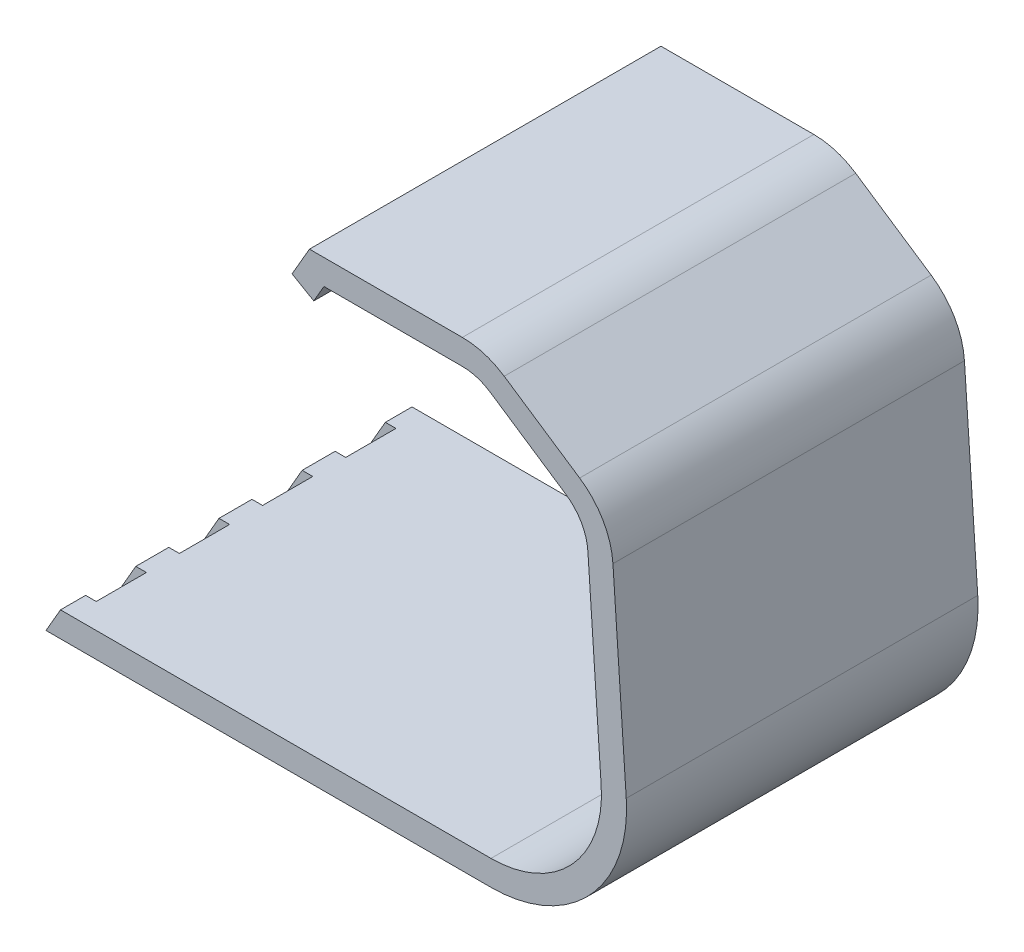
ISO-10303-21;
HEADER;
FILE_DESCRIPTION(('STEP AP214'),'2;1');
FILE_NAME('part.step','',(''),(''),'','','');
FILE_SCHEMA(('AUTOMOTIVE_DESIGN { 1 0 10303 214 1 1 1 1 }'));
ENDSEC;
DATA;
#1=APPLICATION_CONTEXT('core data for automotive mechanical design processes');
#2=APPLICATION_PROTOCOL_DEFINITION('international standard','automotive_design',2000,#1);
#3=PRODUCT_CONTEXT('',#1,'mechanical');
#4=PRODUCT('Part','Part','',(#3));
#5=PRODUCT_RELATED_PRODUCT_CATEGORY('part','',(#4));
#6=PRODUCT_DEFINITION_FORMATION('','',#4);
#7=PRODUCT_DEFINITION_CONTEXT('part definition',#1,'design');
#8=PRODUCT_DEFINITION('design','',#6,#7);
#9=PRODUCT_DEFINITION_SHAPE('','',#8);
#10=(LENGTH_UNIT() NAMED_UNIT(*) SI_UNIT(.MILLI.,.METRE.));
#11=(NAMED_UNIT(*) PLANE_ANGLE_UNIT() SI_UNIT($,.RADIAN.));
#12=(NAMED_UNIT(*) SI_UNIT($,.STERADIAN.) SOLID_ANGLE_UNIT());
#13=UNCERTAINTY_MEASURE_WITH_UNIT(LENGTH_MEASURE(1.E-05),#10,'distance_accuracy_value','');
#14=(GEOMETRIC_REPRESENTATION_CONTEXT(3) GLOBAL_UNCERTAINTY_ASSIGNED_CONTEXT((#13)) GLOBAL_UNIT_ASSIGNED_CONTEXT((#10,
#11,#12)) REPRESENTATION_CONTEXT('',''));
#15=CARTESIAN_POINT('',(0.,0.,0.));
#16=DIRECTION('',(0.,0.,1.));
#17=DIRECTION('',(1.,0.,0.));
#18=AXIS2_PLACEMENT_3D('',#15,#16,#17);
#19=CARTESIAN_POINT('',(115.26537180436,5.,35.));
#20=DIRECTION('',(0.,-1.,0.));
#21=DIRECTION('',(1.,0.,0.));
#22=AXIS2_PLACEMENT_3D('',#19,#20,#21);
#23=PLANE('',#22);
#24=DIRECTION('',(1.,0.,0.));
#25=VECTOR('',#24,1.);
#26=CARTESIAN_POINT('',(-2.2346281956398,5.00000000000002,-29.6875));
#27=LINE('',#26,#25);
#28=CARTESIAN_POINT('',(0.652123150308356,5.00000000000002,-29.6875));
#29=VERTEX_POINT('',#28);
#30=CARTESIAN_POINT('',(2.7653718043602,5.00000000000002,-29.6875));
#31=VERTEX_POINT('',#30);
#32=EDGE_CURVE('E272',#29,#31,#27,.T.);
#33=ORIENTED_EDGE('',*,*,#32,.T.);
#34=DIRECTION('',(0.,0.,-1.));
#35=VECTOR('',#34,1.);
#36=CARTESIAN_POINT('',(2.7653718043602,5.00000000000002,-19.6875));
#37=LINE('',#36,#35);
#38=CARTESIAN_POINT('',(2.7653718043602,5.00000000000002,-19.6875));
#39=VERTEX_POINT('',#38);
#40=EDGE_CURVE('E258',#39,#31,#37,.T.);
#41=ORIENTED_EDGE('',*,*,#40,.F.);
#42=DIRECTION('',(-1.,0.,0.));
#43=VECTOR('',#42,1.);
#44=CARTESIAN_POINT('',(2.7653718043602,5.00000000000002,-19.6875));
#45=LINE('',#44,#43);
#46=CARTESIAN_POINT('',(0.652123150308356,5.00000000000002,-19.6875));
#47=VERTEX_POINT('',#46);
#48=EDGE_CURVE('E266',#39,#47,#45,.T.);
#49=ORIENTED_EDGE('',*,*,#48,.T.);
#50=DIRECTION('',(0.,0.,1.));
#51=VECTOR('',#50,1.);
#52=CARTESIAN_POINT('',(0.652123150308351,5.00000000000002,-35.));
#53=LINE('',#52,#51);
#54=CARTESIAN_POINT('',(0.652123150308354,5.00000000000002,-13.125));
#55=VERTEX_POINT('',#54);
#56=EDGE_CURVE('E354',#47,#55,#53,.T.);
#57=ORIENTED_EDGE('',*,*,#56,.T.);
#58=DIRECTION('',(1.,0.,0.));
#59=VECTOR('',#58,1.);
#60=CARTESIAN_POINT('',(-2.2346281956398,5.00000000000002,-13.125));
#61=LINE('',#60,#59);
#62=CARTESIAN_POINT('',(2.7653718043602,5.00000000000002,-13.125));
#63=VERTEX_POINT('',#62);
#64=EDGE_CURVE('E287',#55,#63,#61,.T.);
#65=ORIENTED_EDGE('',*,*,#64,.T.);
#66=DIRECTION('',(0.,0.,-1.));
#67=VECTOR('',#66,1.);
#68=CARTESIAN_POINT('',(2.7653718043602,5.00000000000002,-3.125));
#69=LINE('',#68,#67);
#70=CARTESIAN_POINT('',(2.7653718043602,5.00000000000002,-3.125));
#71=VERTEX_POINT('',#70);
#72=EDGE_CURVE('E284',#71,#63,#69,.T.);
#73=ORIENTED_EDGE('',*,*,#72,.F.);
#74=DIRECTION('',(-1.,0.,0.));
#75=VECTOR('',#74,1.);
#76=CARTESIAN_POINT('',(2.7653718043602,5.00000000000002,-3.125));
#77=LINE('',#76,#75);
#78=CARTESIAN_POINT('',(0.652123150308354,5.00000000000002,-3.125));
#79=VERTEX_POINT('',#78);
#80=EDGE_CURVE('E281',#71,#79,#77,.T.);
#81=ORIENTED_EDGE('',*,*,#80,.T.);
#82=CARTESIAN_POINT('',(0.652123150308351,5.00000000000002,3.4375));
#83=VERTEX_POINT('',#82);
#84=EDGE_CURVE('E648',#79,#83,#53,.T.);
#85=ORIENTED_EDGE('',*,*,#84,.T.);
#86=DIRECTION('',(1.,0.,0.));
#87=VECTOR('',#86,1.);
#88=CARTESIAN_POINT('',(-2.2346281956398,5.00000000000002,3.4375));
#89=LINE('',#88,#87);
#90=CARTESIAN_POINT('',(2.7653718043602,5.00000000000002,3.4375));
#91=VERTEX_POINT('',#90);
#92=EDGE_CURVE('E307',#83,#91,#89,.T.);
#93=ORIENTED_EDGE('',*,*,#92,.T.);
#94=DIRECTION('',(0.,0.,-1.));
#95=VECTOR('',#94,1.);
#96=CARTESIAN_POINT('',(2.7653718043602,5.00000000000002,13.4375));
#97=LINE('',#96,#95);
#98=CARTESIAN_POINT('',(2.7653718043602,5.00000000000002,13.4375));
#99=VERTEX_POINT('',#98);
#100=EDGE_CURVE('E304',#99,#91,#97,.T.);
#101=ORIENTED_EDGE('',*,*,#100,.F.);
#102=DIRECTION('',(-1.,0.,0.));
#103=VECTOR('',#102,1.);
#104=CARTESIAN_POINT('',(2.7653718043602,5.00000000000002,13.4375));
#105=LINE('',#104,#103);
#106=CARTESIAN_POINT('',(0.652123150308351,5.00000000000002,13.4375));
#107=VERTEX_POINT('',#106);
#108=EDGE_CURVE('E301',#99,#107,#105,.T.);
#109=ORIENTED_EDGE('',*,*,#108,.T.);
#110=CARTESIAN_POINT('',(0.65212315030835,5.00000000000001,20.));
#111=VERTEX_POINT('',#110);
#112=EDGE_CURVE('E632',#107,#111,#53,.T.);
#113=ORIENTED_EDGE('',*,*,#112,.T.);
#114=DIRECTION('',(1.,0.,0.));
#115=VECTOR('',#114,1.);
#116=CARTESIAN_POINT('',(-2.2346281956398,5.00000000000001,20.));
#117=LINE('',#116,#115);
#118=CARTESIAN_POINT('',(2.7653718043602,5.00000000000001,20.));
#119=VERTEX_POINT('',#118);
#120=EDGE_CURVE('E328',#111,#119,#117,.T.);
#121=ORIENTED_EDGE('',*,*,#120,.T.);
#122=DIRECTION('',(0.,0.,-1.));
#123=VECTOR('',#122,1.);
#124=CARTESIAN_POINT('',(2.7653718043602,5.00000000000001,30.));
#125=LINE('',#124,#123);
#126=CARTESIAN_POINT('',(2.7653718043602,5.00000000000001,30.));
#127=VERTEX_POINT('',#126);
#128=EDGE_CURVE('E325',#127,#119,#125,.T.);
#129=ORIENTED_EDGE('',*,*,#128,.F.);
#130=DIRECTION('',(-1.,0.,0.));
#131=VECTOR('',#130,1.);
#132=CARTESIAN_POINT('',(2.7653718043602,5.00000000000001,30.));
#133=LINE('',#132,#131);
#134=CARTESIAN_POINT('',(0.65212315030835,5.00000000000001,30.));
#135=VERTEX_POINT('',#134);
#136=EDGE_CURVE('E322',#127,#135,#133,.T.);
#137=ORIENTED_EDGE('',*,*,#136,.T.);
#138=CARTESIAN_POINT('',(0.652123150308351,5.00000000000002,35.));
#139=VERTEX_POINT('',#138);
#140=EDGE_CURVE('E350',#135,#139,#53,.T.);
#141=ORIENTED_EDGE('',*,*,#140,.T.);
#142=DIRECTION('',(-1.,0.,0.));
#143=VECTOR('',#142,1.);
#144=CARTESIAN_POINT('',(115.26537180436,5.,35.));
#145=LINE('',#144,#143);
#146=CARTESIAN_POINT('',(86.3774038639351,5.,35.));
#147=VERTEX_POINT('',#146);
#148=EDGE_CURVE('E406',#147,#139,#145,.T.);
#149=ORIENTED_EDGE('',*,*,#148,.F.);
#150=DIRECTION('',(0.,0.,-1.));
#151=VECTOR('',#150,1.);
#152=CARTESIAN_POINT('',(86.3774038639351,5.,35.));
#153=LINE('',#152,#151);
#154=CARTESIAN_POINT('',(86.3774038639351,5.,-35.));
#155=VERTEX_POINT('',#154);
#156=EDGE_CURVE('E438',#147,#155,#153,.T.);
#157=ORIENTED_EDGE('',*,*,#156,.T.);
#158=DIRECTION('',(-1.,0.,0.));
#159=VECTOR('',#158,1.);
#160=CARTESIAN_POINT('',(115.26537180436,5.,-35.));
#161=LINE('',#160,#159);
#162=CARTESIAN_POINT('',(0.652123150308343,5.00000000000001,-35.));
#163=VERTEX_POINT('',#162);
#164=EDGE_CURVE('E371',#155,#163,#161,.T.);
#165=ORIENTED_EDGE('',*,*,#164,.T.);
#166=EDGE_CURVE('E351',#163,#29,#53,.T.);
#167=ORIENTED_EDGE('',*,*,#166,.T.);
#168=EDGE_LOOP('',(#33,#41,#49,#57,#65,#73,#81,#85,#93,#101,#109,#113,#121,#129,#137,#141,#149,
#157,#165,#167));
#169=FACE_BOUND('',#168,.T.);
#170=ADVANCED_FACE('F34',(#169),#23,.F.);
#171=CARTESIAN_POINT('',(115.26537180436,0.,35.));
#172=DIRECTION('',(0.,-1.,0.));
#173=DIRECTION('',(1.,0.,0.));
#174=AXIS2_PLACEMENT_3D('',#171,#172,#173);
#175=PLANE('',#174);
#176=DIRECTION('',(0.,0.,-1.));
#177=VECTOR('',#176,1.);
#178=CARTESIAN_POINT('',(2.7653718043602,0.,-19.6875));
#179=LINE('',#178,#177);
#180=CARTESIAN_POINT('',(2.7653718043602,0.,-19.6875));
#181=VERTEX_POINT('',#180);
#182=CARTESIAN_POINT('',(2.7653718043602,0.,-29.6875));
#183=VERTEX_POINT('',#182);
#184=EDGE_CURVE('E261',#181,#183,#179,.T.);
#185=ORIENTED_EDGE('',*,*,#184,.T.);
#186=DIRECTION('',(1.,0.,0.));
#187=VECTOR('',#186,1.);
#188=CARTESIAN_POINT('',(-2.2346281956398,0.,-29.6875));
#189=LINE('',#188,#187);
#190=CARTESIAN_POINT('',(-2.2346281956398,0.,-29.6875));
#191=VERTEX_POINT('',#190);
#192=EDGE_CURVE('E263',#191,#183,#189,.T.);
#193=ORIENTED_EDGE('',*,*,#192,.F.);
#194=DIRECTION('',(0.,0.,-1.));
#195=VECTOR('',#194,1.);
#196=CARTESIAN_POINT('',(-2.2346281956398,0.,35.));
#197=LINE('',#196,#195);
#198=CARTESIAN_POINT('',(-2.2346281956398,0.,-35.));
#199=VERTEX_POINT('',#198);
#200=EDGE_CURVE('E429',#191,#199,#197,.T.);
#201=ORIENTED_EDGE('',*,*,#200,.T.);
#202=DIRECTION('',(-1.,0.,0.));
#203=VECTOR('',#202,1.);
#204=CARTESIAN_POINT('',(115.26537180436,0.,-35.));
#205=LINE('',#204,#203);
#206=CARTESIAN_POINT('',(86.3774038639351,0.,-35.));
#207=VERTEX_POINT('',#206);
#208=EDGE_CURVE('E368',#207,#199,#205,.T.);
#209=ORIENTED_EDGE('',*,*,#208,.F.);
#210=DIRECTION('',(0.,0.,-1.));
#211=VECTOR('',#210,1.);
#212=CARTESIAN_POINT('',(86.3774038639351,0.,35.));
#213=LINE('',#212,#211);
#214=CARTESIAN_POINT('',(86.3774038639351,0.,35.));
#215=VERTEX_POINT('',#214);
#216=EDGE_CURVE('E455',#207,#215,#213,.F.);
#217=ORIENTED_EDGE('',*,*,#216,.T.);
#218=DIRECTION('',(-1.,0.,0.));
#219=VECTOR('',#218,1.);
#220=CARTESIAN_POINT('',(115.26537180436,0.,35.));
#221=LINE('',#220,#219);
#222=CARTESIAN_POINT('',(-2.2346281956398,0.,35.));
#223=VERTEX_POINT('',#222);
#224=EDGE_CURVE('E403',#215,#223,#221,.T.);
#225=ORIENTED_EDGE('',*,*,#224,.T.);
#226=CARTESIAN_POINT('',(-2.2346281956398,0.,30.));
#227=VERTEX_POINT('',#226);
#228=EDGE_CURVE('E430',#223,#227,#197,.T.);
#229=ORIENTED_EDGE('',*,*,#228,.T.);
#230=DIRECTION('',(-1.,0.,0.));
#231=VECTOR('',#230,1.);
#232=CARTESIAN_POINT('',(2.7653718043602,0.,30.));
#233=LINE('',#232,#231);
#234=CARTESIAN_POINT('',(2.7653718043602,0.,30.));
#235=VERTEX_POINT('',#234);
#236=EDGE_CURVE('E331',#235,#227,#233,.T.);
#237=ORIENTED_EDGE('',*,*,#236,.F.);
#238=DIRECTION('',(0.,0.,-1.));
#239=VECTOR('',#238,1.);
#240=CARTESIAN_POINT('',(2.7653718043602,0.,30.));
#241=LINE('',#240,#239);
#242=CARTESIAN_POINT('',(2.7653718043602,0.,20.));
#243=VERTEX_POINT('',#242);
#244=EDGE_CURVE('E333',#235,#243,#241,.T.);
#245=ORIENTED_EDGE('',*,*,#244,.T.);
#246=DIRECTION('',(1.,0.,0.));
#247=VECTOR('',#246,1.);
#248=CARTESIAN_POINT('',(-2.2346281956398,0.,20.));
#249=LINE('',#248,#247);
#250=CARTESIAN_POINT('',(-2.2346281956398,0.,20.));
#251=VERTEX_POINT('',#250);
#252=EDGE_CURVE('E336',#251,#243,#249,.T.);
#253=ORIENTED_EDGE('',*,*,#252,.F.);
#254=CARTESIAN_POINT('',(-2.2346281956398,0.,13.4375));
#255=VERTEX_POINT('',#254);
#256=EDGE_CURVE('E434',#251,#255,#197,.T.);
#257=ORIENTED_EDGE('',*,*,#256,.T.);
#258=DIRECTION('',(-1.,0.,0.));
#259=VECTOR('',#258,1.);
#260=CARTESIAN_POINT('',(2.7653718043602,0.,13.4375));
#261=LINE('',#260,#259);
#262=CARTESIAN_POINT('',(2.7653718043602,0.,13.4375));
#263=VERTEX_POINT('',#262);
#264=EDGE_CURVE('E310',#263,#255,#261,.T.);
#265=ORIENTED_EDGE('',*,*,#264,.F.);
#266=DIRECTION('',(0.,0.,-1.));
#267=VECTOR('',#266,1.);
#268=CARTESIAN_POINT('',(2.7653718043602,0.,13.4375));
#269=LINE('',#268,#267);
#270=CARTESIAN_POINT('',(2.7653718043602,0.,3.4375));
#271=VERTEX_POINT('',#270);
#272=EDGE_CURVE('E312',#263,#271,#269,.T.);
#273=ORIENTED_EDGE('',*,*,#272,.T.);
#274=DIRECTION('',(1.,0.,0.));
#275=VECTOR('',#274,1.);
#276=CARTESIAN_POINT('',(-2.2346281956398,0.,3.4375));
#277=LINE('',#276,#275);
#278=CARTESIAN_POINT('',(-2.2346281956398,0.,3.4375));
#279=VERTEX_POINT('',#278);
#280=EDGE_CURVE('E315',#279,#271,#277,.T.);
#281=ORIENTED_EDGE('',*,*,#280,.F.);
#282=CARTESIAN_POINT('',(-2.2346281956398,0.,-3.125));
#283=VERTEX_POINT('',#282);
#284=EDGE_CURVE('E525',#279,#283,#197,.T.);
#285=ORIENTED_EDGE('',*,*,#284,.T.);
#286=DIRECTION('',(-1.,0.,0.));
#287=VECTOR('',#286,1.);
#288=CARTESIAN_POINT('',(2.7653718043602,0.,-3.125));
#289=LINE('',#288,#287);
#290=CARTESIAN_POINT('',(2.7653718043602,0.,-3.125));
#291=VERTEX_POINT('',#290);
#292=EDGE_CURVE('E57',#291,#283,#289,.T.);
#293=ORIENTED_EDGE('',*,*,#292,.F.);
#294=DIRECTION('',(0.,0.,-1.));
#295=VECTOR('',#294,1.);
#296=CARTESIAN_POINT('',(2.7653718043602,0.,-3.125));
#297=LINE('',#296,#295);
#298=CARTESIAN_POINT('',(2.7653718043602,0.,-13.125));
#299=VERTEX_POINT('',#298);
#300=EDGE_CURVE('E291',#291,#299,#297,.T.);
#301=ORIENTED_EDGE('',*,*,#300,.T.);
#302=DIRECTION('',(1.,0.,0.));
#303=VECTOR('',#302,1.);
#304=CARTESIAN_POINT('',(-2.2346281956398,0.,-13.125));
#305=LINE('',#304,#303);
#306=CARTESIAN_POINT('',(-2.2346281956398,0.,-13.125));
#307=VERTEX_POINT('',#306);
#308=EDGE_CURVE('E294',#307,#299,#305,.T.);
#309=ORIENTED_EDGE('',*,*,#308,.F.);
#310=CARTESIAN_POINT('',(-2.2346281956398,0.,-19.6875));
#311=VERTEX_POINT('',#310);
#312=EDGE_CURVE('E522',#307,#311,#197,.T.);
#313=ORIENTED_EDGE('',*,*,#312,.T.);
#314=DIRECTION('',(-1.,0.,0.));
#315=VECTOR('',#314,1.);
#316=CARTESIAN_POINT('',(2.7653718043602,0.,-19.6875));
#317=LINE('',#316,#315);
#318=EDGE_CURVE('E49',#181,#311,#317,.T.);
#319=ORIENTED_EDGE('',*,*,#318,.F.);
#320=EDGE_LOOP('',(#185,#193,#201,#209,#217,#225,#229,#237,#245,#253,#257,#265,#273,#281,#285,
#293,#301,#309,#313,#319));
#321=FACE_BOUND('',#320,.T.);
#322=ADVANCED_FACE('F521',(#321),#175,.T.);
#323=CARTESIAN_POINT('',(-2.2346281956398,0.,-35.));
#324=DIRECTION('',(0.866025403784437,-0.500000000000003,0.));
#325=DIRECTION('',(0.500000000000003,0.866025403784437,0.));
#326=AXIS2_PLACEMENT_3D('',#323,#324,#325);
#327=PLANE('',#326);
#328=DIRECTION('',(-0.500000000000003,-0.866025403784437,0.));
#329=VECTOR('',#328,1.);
#330=CARTESIAN_POINT('',(-2.2346281956398,0.,-29.6875));
#331=LINE('',#330,#329);
#332=EDGE_CURVE('E11',#29,#191,#331,.T.);
#333=ORIENTED_EDGE('',*,*,#332,.F.);
#334=ORIENTED_EDGE('',*,*,#166,.F.);
#335=DIRECTION('',(0.500000000000003,0.866025403784437,0.));
#336=VECTOR('',#335,1.);
#337=CARTESIAN_POINT('',(-2.2346281956398,0.,-35.));
#338=LINE('',#337,#336);
#339=EDGE_CURVE('E347',#199,#163,#338,.T.);
#340=ORIENTED_EDGE('',*,*,#339,.F.);
#341=ORIENTED_EDGE('',*,*,#200,.F.);
#342=EDGE_LOOP('',(#333,#334,#340,#341));
#343=FACE_BOUND('',#342,.T.);
#344=ADVANCED_FACE('F539',(#343),#327,.F.);
#345=DIRECTION('',(0.500000000000003,0.866025403784437,0.));
#346=VECTOR('',#345,1.);
#347=CARTESIAN_POINT('',(-2.2346281956398,0.,-19.6875));
#348=LINE('',#347,#346);
#349=EDGE_CURVE('E42',#311,#47,#348,.T.);
#350=ORIENTED_EDGE('',*,*,#349,.F.);
#351=ORIENTED_EDGE('',*,*,#312,.F.);
#352=DIRECTION('',(-0.500000000000003,-0.866025403784437,0.));
#353=VECTOR('',#352,1.);
#354=CARTESIAN_POINT('',(-2.2346281956398,0.,-13.125));
#355=LINE('',#354,#353);
#356=EDGE_CURVE('E511',#55,#307,#355,.T.);
#357=ORIENTED_EDGE('',*,*,#356,.F.);
#358=ORIENTED_EDGE('',*,*,#56,.F.);
#359=EDGE_LOOP('',(#350,#351,#357,#358));
#360=FACE_BOUND('',#359,.T.);
#361=ADVANCED_FACE('F524',(#360),#327,.F.);
#362=DIRECTION('',(0.500000000000003,0.866025403784437,0.));
#363=VECTOR('',#362,1.);
#364=CARTESIAN_POINT('',(-2.2346281956398,0.,-3.125));
#365=LINE('',#364,#363);
#366=EDGE_CURVE('E509',#283,#79,#365,.T.);
#367=ORIENTED_EDGE('',*,*,#366,.F.);
#368=ORIENTED_EDGE('',*,*,#284,.F.);
#369=DIRECTION('',(-0.500000000000003,-0.866025403784437,0.));
#370=VECTOR('',#369,1.);
#371=CARTESIAN_POINT('',(-2.2346281956398,0.,3.4375));
#372=LINE('',#371,#370);
#373=EDGE_CURVE('E507',#83,#279,#372,.T.);
#374=ORIENTED_EDGE('',*,*,#373,.F.);
#375=ORIENTED_EDGE('',*,*,#84,.F.);
#376=EDGE_LOOP('',(#367,#368,#374,#375));
#377=FACE_BOUND('',#376,.T.);
#378=ADVANCED_FACE('F646',(#377),#327,.F.);
#379=DIRECTION('',(0.500000000000003,0.866025403784437,0.));
#380=VECTOR('',#379,1.);
#381=CARTESIAN_POINT('',(-2.2346281956398,0.,13.4375));
#382=LINE('',#381,#380);
#383=EDGE_CURVE('E505',#255,#107,#382,.T.);
#384=ORIENTED_EDGE('',*,*,#383,.F.);
#385=ORIENTED_EDGE('',*,*,#256,.F.);
#386=DIRECTION('',(-0.500000000000003,-0.866025403784437,0.));
#387=VECTOR('',#386,1.);
#388=CARTESIAN_POINT('',(-2.2346281956398,0.,20.));
#389=LINE('',#388,#387);
#390=EDGE_CURVE('E503',#111,#251,#389,.T.);
#391=ORIENTED_EDGE('',*,*,#390,.F.);
#392=ORIENTED_EDGE('',*,*,#112,.F.);
#393=EDGE_LOOP('',(#384,#385,#391,#392));
#394=FACE_BOUND('',#393,.T.);
#395=ADVANCED_FACE('F630',(#394),#327,.F.);
#396=DIRECTION('',(0.500000000000003,0.866025403784437,0.));
#397=VECTOR('',#396,1.);
#398=CARTESIAN_POINT('',(-2.2346281956398,0.,30.));
#399=LINE('',#398,#397);
#400=EDGE_CURVE('E501',#227,#135,#399,.T.);
#401=ORIENTED_EDGE('',*,*,#400,.F.);
#402=ORIENTED_EDGE('',*,*,#228,.F.);
#403=DIRECTION('',(0.500000000000003,0.866025403784437,0.));
#404=VECTOR('',#403,1.);
#405=CARTESIAN_POINT('',(-2.2346281956398,0.,35.));
#406=LINE('',#405,#404);
#407=EDGE_CURVE('E343',#223,#139,#406,.T.);
#408=ORIENTED_EDGE('',*,*,#407,.T.);
#409=ORIENTED_EDGE('',*,*,#140,.F.);
#410=EDGE_LOOP('',(#401,#402,#408,#409));
#411=FACE_BOUND('',#410,.T.);
#412=ADVANCED_FACE('F611',(#411),#327,.F.);
#413=CARTESIAN_POINT('',(51.0954988232824,83.5,35.));
#414=DIRECTION('',(-0.500000000000003,-0.866025403784437,0.));
#415=DIRECTION('',(0.866025403784437,-0.500000000000003,0.));
#416=AXIS2_PLACEMENT_3D('',#413,#414,#415);
#417=PLANE('',#416);
#418=DIRECTION('',(0.,0.,-1.));
#419=VECTOR('',#418,1.);
#420=CARTESIAN_POINT('',(51.0954988232824,83.5,35.));
#421=LINE('',#420,#419);
#422=CARTESIAN_POINT('',(51.0954988232824,83.5,35.));
#423=VERTEX_POINT('',#422);
#424=CARTESIAN_POINT('',(51.0954988232824,83.5,-35.));
#425=VERTEX_POINT('',#424);
#426=EDGE_CURVE('E436',#423,#425,#421,.T.);
#427=ORIENTED_EDGE('',*,*,#426,.F.);
#428=DIRECTION('',(-0.866025403784437,0.500000000000003,0.));
#429=VECTOR('',#428,1.);
#430=CARTESIAN_POINT('',(51.0954988232824,83.5,35.));
#431=LINE('',#430,#429);
#432=CARTESIAN_POINT('',(46.7653718043602,86.,35.));
#433=VERTEX_POINT('',#432);
#434=EDGE_CURVE('E384',#423,#433,#431,.T.);
#435=ORIENTED_EDGE('',*,*,#434,.T.);
#436=DIRECTION('',(0.,0.,-1.));
#437=VECTOR('',#436,1.);
#438=CARTESIAN_POINT('',(46.7653718043602,86.,35.));
#439=LINE('',#438,#437);
#440=CARTESIAN_POINT('',(46.7653718043602,86.,-35.));
#441=VERTEX_POINT('',#440);
#442=EDGE_CURVE('E425',#433,#441,#439,.T.);
#443=ORIENTED_EDGE('',*,*,#442,.T.);
#444=DIRECTION('',(-0.866025403784437,0.500000000000003,0.));
#445=VECTOR('',#444,1.);
#446=CARTESIAN_POINT('',(51.0954988232824,83.5,-35.));
#447=LINE('',#446,#445);
#448=EDGE_CURVE('E353',#425,#441,#447,.T.);
#449=ORIENTED_EDGE('',*,*,#448,.F.);
#450=EDGE_LOOP('',(#427,#435,#443,#449));
#451=FACE_BOUND('',#450,.T.);
#452=ADVANCED_FACE('F680',(#451),#417,.T.);
#453=CARTESIAN_POINT('',(51.0954988232824,83.5,35.));
#454=DIRECTION('',(-0.866025403784437,0.500000000000003,0.));
#455=DIRECTION('',(-0.500000000000003,-0.866025403784437,0.));
#456=AXIS2_PLACEMENT_3D('',#453,#454,#455);
#457=PLANE('',#456);
#458=DIRECTION('',(0.,0.,-1.));
#459=VECTOR('',#458,1.);
#460=CARTESIAN_POINT('',(53.1162247654461,87.,35.));
#461=LINE('',#460,#459);
#462=CARTESIAN_POINT('',(53.1162247654461,87.,35.));
#463=VERTEX_POINT('',#462);
#464=CARTESIAN_POINT('',(53.1162247654461,87.,-35.));
#465=VERTEX_POINT('',#464);
#466=EDGE_CURVE('E433',#463,#465,#461,.T.);
#467=ORIENTED_EDGE('',*,*,#466,.F.);
#468=DIRECTION('',(0.500000000000003,0.866025403784437,0.));
#469=VECTOR('',#468,1.);
#470=CARTESIAN_POINT('',(51.0954988232824,83.5,35.));
#471=LINE('',#470,#469);
#472=EDGE_CURVE('E421',#423,#463,#471,.T.);
#473=ORIENTED_EDGE('',*,*,#472,.F.);
#474=ORIENTED_EDGE('',*,*,#426,.T.);
#475=DIRECTION('',(0.500000000000003,0.866025403784437,0.));
#476=VECTOR('',#475,1.);
#477=CARTESIAN_POINT('',(51.0954988232824,83.5,-35.));
#478=LINE('',#477,#476);
#479=EDGE_CURVE('E381',#425,#465,#478,.T.);
#480=ORIENTED_EDGE('',*,*,#479,.T.);
#481=EDGE_LOOP('',(#467,#473,#474,#480));
#482=FACE_BOUND('',#481,.T.);
#483=ADVANCED_FACE('F36',(#482),#457,.F.);
#484=CARTESIAN_POINT('',(50.229473419498,87.,35.));
#485=DIRECTION('',(0.,1.,0.));
#486=DIRECTION('',(0.,0.,1.));
#487=AXIS2_PLACEMENT_3D('',#484,#485,#486);
#488=PLANE('',#487);
#489=DIRECTION('',(1.,0.,0.));
#490=VECTOR('',#489,1.);
#491=CARTESIAN_POINT('',(50.229473419498,87.,-35.));
#492=LINE('',#491,#490);
#493=CARTESIAN_POINT('',(80.677626658111,87.,-35.));
#494=VERTEX_POINT('',#493);
#495=EDGE_CURVE('E378',#465,#494,#492,.T.);
#496=ORIENTED_EDGE('',*,*,#495,.T.);
#497=DIRECTION('',(0.,0.,-1.));
#498=VECTOR('',#497,1.);
#499=CARTESIAN_POINT('',(80.677626658111,87.,35.));
#500=LINE('',#499,#498);
#501=CARTESIAN_POINT('',(80.677626658111,87.,35.));
#502=VERTEX_POINT('',#501);
#503=EDGE_CURVE('E486',#494,#502,#500,.F.);
#504=ORIENTED_EDGE('',*,*,#503,.T.);
#505=DIRECTION('',(1.,0.,0.));
#506=VECTOR('',#505,1.);
#507=CARTESIAN_POINT('',(50.229473419498,87.,35.));
#508=LINE('',#507,#506);
#509=EDGE_CURVE('E417',#463,#502,#508,.T.);
#510=ORIENTED_EDGE('',*,*,#509,.F.);
#511=ORIENTED_EDGE('',*,*,#466,.T.);
#512=EDGE_LOOP('',(#496,#504,#510,#511));
#513=FACE_BOUND('',#512,.T.);
#514=ADVANCED_FACE('F567',(#513),#488,.F.);
#515=CARTESIAN_POINT('',(82.4507865627108,87.8432104513317,35.));
#516=DIRECTION('',(0.55573737135744,0.831357909733662,0.));
#517=DIRECTION('',(-0.831357909733662,0.55573737135744,0.));
#518=AXIS2_PLACEMENT_3D('',#515,#516,#517);
#519=PLANE('',#518);
#520=DIRECTION('',(0.831357909733662,-0.555737371357439,0.));
#521=VECTOR('',#520,1.);
#522=CARTESIAN_POINT('',(82.4507865627108,87.8432104513317,35.));
#523=LINE('',#522,#521);
#524=CARTESIAN_POINT('',(86.2350003716854,85.3135790973366,35.));
#525=VERTEX_POINT('',#524);
#526=CARTESIAN_POINT('',(101.25954480802,75.2701300206729,35.));
#527=VERTEX_POINT('',#526);
#528=EDGE_CURVE('E413',#525,#527,#523,.T.);
#529=ORIENTED_EDGE('',*,*,#528,.F.);
#530=DIRECTION('',(0.,0.,-1.));
#531=VECTOR('',#530,1.);
#532=CARTESIAN_POINT('',(86.2350003716854,85.3135790973366,35.));
#533=LINE('',#532,#531);
#534=CARTESIAN_POINT('',(86.2350003716854,85.3135790973366,-35.));
#535=VERTEX_POINT('',#534);
#536=EDGE_CURVE('E483',#525,#535,#533,.T.);
#537=ORIENTED_EDGE('',*,*,#536,.T.);
#538=DIRECTION('',(0.831357909733662,-0.555737371357439,0.));
#539=VECTOR('',#538,1.);
#540=CARTESIAN_POINT('',(82.4507865627108,87.8432104513317,-35.));
#541=LINE('',#540,#539);
#542=CARTESIAN_POINT('',(101.25954480802,75.2701300206729,-35.));
#543=VERTEX_POINT('',#542);
#544=EDGE_CURVE('E375',#535,#543,#541,.T.);
#545=ORIENTED_EDGE('',*,*,#544,.T.);
#546=DIRECTION('',(0.,0.,-1.));
#547=VECTOR('',#546,1.);
#548=CARTESIAN_POINT('',(101.25954480802,75.2701300206729,35.));
#549=LINE('',#548,#547);
#550=EDGE_CURVE('E481',#543,#527,#549,.F.);
#551=ORIENTED_EDGE('',*,*,#550,.T.);
#552=EDGE_LOOP('',(#529,#537,#545,#551));
#553=FACE_BOUND('',#552,.T.);
#554=ADVANCED_FACE('F558',(#553),#519,.F.);
#555=CARTESIAN_POINT('',(105.181609462549,74.990450972333,35.));
#556=DIRECTION('',(0.997720249791746,0.0674855773887729,0.));
#557=DIRECTION('',(-0.0674855773887729,0.997720249791746,0.));
#558=AXIS2_PLACEMENT_3D('',#555,#556,#557);
#559=PLANE('',#558);
#560=DIRECTION('',(0.0674855773887729,-0.997720249791746,0.));
#561=VECTOR('',#560,1.);
#562=CARTESIAN_POINT('',(105.181609462549,74.990450972333,35.));
#563=LINE('',#562,#561);
#564=CARTESIAN_POINT('',(105.679373592363,67.6314066972241,35.));
#565=VERTEX_POINT('',#564);
#566=CARTESIAN_POINT('',(108.327249359354,28.484682702553,35.));
#567=VERTEX_POINT('',#566);
#568=EDGE_CURVE('E410',#565,#567,#563,.T.);
#569=ORIENTED_EDGE('',*,*,#568,.F.);
#570=DIRECTION('',(0.,0.,-1.));
#571=VECTOR('',#570,1.);
#572=CARTESIAN_POINT('',(105.679373592363,67.6314066972241,35.));
#573=LINE('',#572,#571);
#574=CARTESIAN_POINT('',(105.679373592363,67.6314066972241,-35.));
#575=VERTEX_POINT('',#574);
#576=EDGE_CURVE('E488',#565,#575,#573,.T.);
#577=ORIENTED_EDGE('',*,*,#576,.T.);
#578=DIRECTION('',(0.0674855773887729,-0.997720249791746,0.));
#579=VECTOR('',#578,1.);
#580=CARTESIAN_POINT('',(105.181609462549,74.990450972333,-35.));
#581=LINE('',#580,#579);
#582=CARTESIAN_POINT('',(108.327249359354,28.484682702553,-35.));
#583=VERTEX_POINT('',#582);
#584=EDGE_CURVE('E373',#575,#583,#581,.T.);
#585=ORIENTED_EDGE('',*,*,#584,.T.);
#586=DIRECTION('',(0.,0.,-1.));
#587=VECTOR('',#586,1.);
#588=CARTESIAN_POINT('',(108.327249359354,28.484682702553,35.));
#589=LINE('',#588,#587);
#590=EDGE_CURVE('E441',#583,#567,#589,.F.);
#591=ORIENTED_EDGE('',*,*,#590,.T.);
#592=EDGE_LOOP('',(#569,#577,#585,#591));
#593=FACE_BOUND('',#592,.T.);
#594=ADVANCED_FACE('F549',(#593),#559,.F.);
#595=CARTESIAN_POINT('',(110.170210711508,75.3278788592768,35.));
#596=DIRECTION('',(0.997720249791746,0.0674855773887729,0.));
#597=DIRECTION('',(-0.0674855773887729,0.997720249791746,0.));
#598=AXIS2_PLACEMENT_3D('',#595,#596,#597);
#599=PLANE('',#598);
#600=DIRECTION('',(0.0674855773887729,-0.997720249791746,0.));
#601=VECTOR('',#600,1.);
#602=CARTESIAN_POINT('',(110.170210711508,75.3278788592768,-35.));
#603=LINE('',#602,#601);
#604=CARTESIAN_POINT('',(110.667974841322,67.9688345841679,-35.));
#605=VERTEX_POINT('',#604);
#606=CARTESIAN_POINT('',(113.315850608312,28.8221105894969,-35.));
#607=VERTEX_POINT('',#606);
#608=EDGE_CURVE('E366',#605,#607,#603,.T.);
#609=ORIENTED_EDGE('',*,*,#608,.F.);
#610=DIRECTION('',(0.,0.,-1.));
#611=VECTOR('',#610,1.);
#612=CARTESIAN_POINT('',(110.667974841322,67.9688345841679,35.));
#613=LINE('',#612,#611);
#614=CARTESIAN_POINT('',(110.667974841322,67.9688345841679,35.));
#615=VERTEX_POINT('',#614);
#616=EDGE_CURVE('E470',#605,#615,#613,.F.);
#617=ORIENTED_EDGE('',*,*,#616,.T.);
#618=DIRECTION('',(0.0674855773887729,-0.997720249791746,0.));
#619=VECTOR('',#618,1.);
#620=CARTESIAN_POINT('',(110.170210711508,75.3278788592768,35.));
#621=LINE('',#620,#619);
#622=CARTESIAN_POINT('',(113.315850608312,28.8221105894969,35.));
#623=VERTEX_POINT('',#622);
#624=EDGE_CURVE('E400',#615,#623,#621,.T.);
#625=ORIENTED_EDGE('',*,*,#624,.T.);
#626=DIRECTION('',(0.,0.,-1.));
#627=VECTOR('',#626,1.);
#628=CARTESIAN_POINT('',(113.315850608312,28.8221105894969,35.));
#629=LINE('',#628,#627);
#630=EDGE_CURVE('E450',#623,#607,#629,.T.);
#631=ORIENTED_EDGE('',*,*,#630,.T.);
#632=EDGE_LOOP('',(#609,#617,#625,#631));
#633=FACE_BOUND('',#632,.T.);
#634=ADVANCED_FACE('F600',(#633),#599,.T.);
#635=CARTESIAN_POINT('',(85.229473419498,92.,35.));
#636=DIRECTION('',(0.55573737135744,0.831357909733662,0.));
#637=DIRECTION('',(-0.831357909733662,0.55573737135744,0.));
#638=AXIS2_PLACEMENT_3D('',#635,#636,#637);
#639=PLANE('',#638);
#640=DIRECTION('',(0.831357909733662,-0.55573737135744,0.));
#641=VECTOR('',#640,1.);
#642=CARTESIAN_POINT('',(85.229473419498,92.,35.));
#643=LINE('',#642,#641);
#644=CARTESIAN_POINT('',(89.0136872284726,89.4703686460049,35.));
#645=VERTEX_POINT('',#644);
#646=CARTESIAN_POINT('',(104.038231664807,79.4269195693413,35.));
#647=VERTEX_POINT('',#646);
#648=EDGE_CURVE('E396',#645,#647,#643,.T.);
#649=ORIENTED_EDGE('',*,*,#648,.T.);
#650=DIRECTION('',(0.,0.,-1.));
#651=VECTOR('',#650,1.);
#652=CARTESIAN_POINT('',(104.038231664807,79.4269195693413,35.));
#653=LINE('',#652,#651);
#654=CARTESIAN_POINT('',(104.038231664807,79.4269195693413,-35.));
#655=VERTEX_POINT('',#654);
#656=EDGE_CURVE('E463',#647,#655,#653,.T.);
#657=ORIENTED_EDGE('',*,*,#656,.T.);
#658=DIRECTION('',(0.831357909733662,-0.55573737135744,0.));
#659=VECTOR('',#658,1.);
#660=CARTESIAN_POINT('',(85.229473419498,92.,-35.));
#661=LINE('',#660,#659);
#662=CARTESIAN_POINT('',(89.0136872284726,89.4703686460049,-35.));
#663=VERTEX_POINT('',#662);
#664=EDGE_CURVE('E363',#663,#655,#661,.T.);
#665=ORIENTED_EDGE('',*,*,#664,.F.);
#666=DIRECTION('',(0.,0.,-1.));
#667=VECTOR('',#666,1.);
#668=CARTESIAN_POINT('',(89.0136872284726,89.4703686460049,35.));
#669=LINE('',#668,#667);
#670=EDGE_CURVE('E461',#663,#645,#669,.F.);
#671=ORIENTED_EDGE('',*,*,#670,.T.);
#672=EDGE_LOOP('',(#649,#657,#665,#671));
#673=FACE_BOUND('',#672,.T.);
#674=ADVANCED_FACE('F586',(#673),#639,.T.);
#675=CARTESIAN_POINT('',(50.229473419498,92.,35.));
#676=DIRECTION('',(0.,1.,0.));
#677=DIRECTION('',(0.,0.,1.));
#678=AXIS2_PLACEMENT_3D('',#675,#676,#677);
#679=PLANE('',#678);
#680=DIRECTION('',(1.,0.,0.));
#681=VECTOR('',#680,1.);
#682=CARTESIAN_POINT('',(50.229473419498,92.,35.));
#683=LINE('',#682,#681);
#684=CARTESIAN_POINT('',(50.229473419498,92.,35.));
#685=VERTEX_POINT('',#684);
#686=CARTESIAN_POINT('',(80.677626658111,92.,35.));
#687=VERTEX_POINT('',#686);
#688=EDGE_CURVE('E392',#685,#687,#683,.T.);
#689=ORIENTED_EDGE('',*,*,#688,.T.);
#690=DIRECTION('',(0.,0.,-1.));
#691=VECTOR('',#690,1.);
#692=CARTESIAN_POINT('',(80.677626658111,92.,35.));
#693=LINE('',#692,#691);
#694=CARTESIAN_POINT('',(80.677626658111,92.,-35.));
#695=VERTEX_POINT('',#694);
#696=EDGE_CURVE('E478',#687,#695,#693,.T.);
#697=ORIENTED_EDGE('',*,*,#696,.T.);
#698=DIRECTION('',(1.,0.,0.));
#699=VECTOR('',#698,1.);
#700=CARTESIAN_POINT('',(50.229473419498,92.,-35.));
#701=LINE('',#700,#699);
#702=CARTESIAN_POINT('',(50.229473419498,92.,-35.));
#703=VERTEX_POINT('',#702);
#704=EDGE_CURVE('E360',#703,#695,#701,.T.);
#705=ORIENTED_EDGE('',*,*,#704,.F.);
#706=DIRECTION('',(0.,0.,-1.));
#707=VECTOR('',#706,1.);
#708=CARTESIAN_POINT('',(50.229473419498,92.,35.));
#709=LINE('',#708,#707);
#710=EDGE_CURVE('E427',#685,#703,#709,.T.);
#711=ORIENTED_EDGE('',*,*,#710,.F.);
#712=EDGE_LOOP('',(#689,#697,#705,#711));
#713=FACE_BOUND('',#712,.T.);
#714=ADVANCED_FACE('F580',(#713),#679,.T.);
#715=CARTESIAN_POINT('',(46.7653718043602,86.,35.));
#716=DIRECTION('',(-0.866025403784437,0.500000000000003,0.));
#717=DIRECTION('',(-0.500000000000003,-0.866025403784437,0.));
#718=AXIS2_PLACEMENT_3D('',#715,#716,#717);
#719=PLANE('',#718);
#720=DIRECTION('',(0.500000000000003,0.866025403784437,0.));
#721=VECTOR('',#720,1.);
#722=CARTESIAN_POINT('',(46.7653718043602,86.,35.));
#723=LINE('',#722,#721);
#724=EDGE_CURVE('E388',#433,#685,#723,.T.);
#725=ORIENTED_EDGE('',*,*,#724,.T.);
#726=ORIENTED_EDGE('',*,*,#710,.T.);
#727=DIRECTION('',(0.500000000000003,0.866025403784437,0.));
#728=VECTOR('',#727,1.);
#729=CARTESIAN_POINT('',(46.7653718043602,86.,-35.));
#730=LINE('',#729,#728);
#731=EDGE_CURVE('E357',#441,#703,#730,.T.);
#732=ORIENTED_EDGE('',*,*,#731,.F.);
#733=ORIENTED_EDGE('',*,*,#442,.F.);
#734=EDGE_LOOP('',(#725,#726,#732,#733));
#735=FACE_BOUND('',#734,.T.);
#736=ADVANCED_FACE('F576',(#735),#719,.T.);
#737=CARTESIAN_POINT('',(46.7653718043602,86.,35.));
#738=DIRECTION('',(0.,0.,-1.));
#739=DIRECTION('',(-1.,0.,0.));
#740=AXIS2_PLACEMENT_3D('',#737,#738,#739);
#741=PLANE('',#740);
#742=ORIENTED_EDGE('',*,*,#624,.F.);
#743=CARTESIAN_POINT('',(95.7021710944455,66.9565509233363,35.));
#744=DIRECTION('',(0.,0.,-1.));
#745=DIRECTION('',(-1.,0.,0.));
#746=AXIS2_PLACEMENT_3D('',#743,#744,#745);
#747=CIRCLE('',#746,15.);
#748=EDGE_CURVE('E475',#615,#647,#747,.F.);
#749=ORIENTED_EDGE('',*,*,#748,.T.);
#750=ORIENTED_EDGE('',*,*,#648,.F.);
#751=CARTESIAN_POINT('',(80.677626658111,77.,35.));
#752=DIRECTION('',(0.,0.,-1.));
#753=DIRECTION('',(-1.,0.,0.));
#754=AXIS2_PLACEMENT_3D('',#751,#752,#753);
#755=CIRCLE('',#754,15.);
#756=EDGE_CURVE('E472',#645,#687,#755,.F.);
#757=ORIENTED_EDGE('',*,*,#756,.T.);
#758=ORIENTED_EDGE('',*,*,#688,.F.);
#759=ORIENTED_EDGE('',*,*,#724,.F.);
#760=ORIENTED_EDGE('',*,*,#434,.F.);
#761=ORIENTED_EDGE('',*,*,#472,.T.);
#762=ORIENTED_EDGE('',*,*,#509,.T.);
#763=CARTESIAN_POINT('',(80.677626658111,77.,35.));
#764=DIRECTION('',(0.,0.,-1.));
#765=DIRECTION('',(-1.,0.,0.));
#766=AXIS2_PLACEMENT_3D('',#763,#764,#765);
#767=CIRCLE('',#766,10.);
#768=EDGE_CURVE('E493',#502,#525,#767,.T.);
#769=ORIENTED_EDGE('',*,*,#768,.T.);
#770=ORIENTED_EDGE('',*,*,#528,.T.);
#771=CARTESIAN_POINT('',(95.7021710944455,66.9565509233363,35.));
#772=DIRECTION('',(0.,0.,-1.));
#773=DIRECTION('',(-1.,0.,0.));
#774=AXIS2_PLACEMENT_3D('',#771,#772,#773);
#775=CIRCLE('',#774,10.);
#776=EDGE_CURVE('E498',#527,#565,#775,.T.);
#777=ORIENTED_EDGE('',*,*,#776,.T.);
#778=ORIENTED_EDGE('',*,*,#568,.T.);
#779=CARTESIAN_POINT('',(86.3774038639351,27.,35.));
#780=DIRECTION('',(0.,0.,-1.));
#781=DIRECTION('',(-1.,0.,0.));
#782=AXIS2_PLACEMENT_3D('',#779,#780,#781);
#783=CIRCLE('',#782,22.);
#784=EDGE_CURVE('E447',#567,#147,#783,.T.);
#785=ORIENTED_EDGE('',*,*,#784,.T.);
#786=ORIENTED_EDGE('',*,*,#148,.T.);
#787=ORIENTED_EDGE('',*,*,#407,.F.);
#788=ORIENTED_EDGE('',*,*,#224,.F.);
#789=CARTESIAN_POINT('',(86.3774038639351,27.,35.));
#790=DIRECTION('',(0.,0.,-1.));
#791=DIRECTION('',(-1.,0.,0.));
#792=AXIS2_PLACEMENT_3D('',#789,#790,#791);
#793=CIRCLE('',#792,27.);
#794=EDGE_CURVE('E457',#215,#623,#793,.F.);
#795=ORIENTED_EDGE('',*,*,#794,.T.);
#796=EDGE_LOOP('',(#742,#749,#750,#757,#758,#759,#760,#761,#762,#769,#770,#777,#778,#785,#786,
#787,#788,#795));
#797=FACE_BOUND('',#796,.T.);
#798=ADVANCED_FACE('F593',(#797),#741,.F.);
#799=CARTESIAN_POINT('',(46.7653718043602,86.,-35.));
#800=DIRECTION('',(0.,0.,-1.));
#801=DIRECTION('',(-1.,0.,0.));
#802=AXIS2_PLACEMENT_3D('',#799,#800,#801);
#803=PLANE('',#802);
#804=ORIENTED_EDGE('',*,*,#664,.T.);
#805=CARTESIAN_POINT('',(95.7021710944455,66.9565509233363,-35.));
#806=DIRECTION('',(0.,0.,-1.));
#807=DIRECTION('',(-1.,0.,0.));
#808=AXIS2_PLACEMENT_3D('',#805,#806,#807);
#809=CIRCLE('',#808,15.);
#810=EDGE_CURVE('E468',#655,#605,#809,.T.);
#811=ORIENTED_EDGE('',*,*,#810,.T.);
#812=ORIENTED_EDGE('',*,*,#608,.T.);
#813=CARTESIAN_POINT('',(86.3774038639351,27.,-35.));
#814=DIRECTION('',(0.,0.,-1.));
#815=DIRECTION('',(-1.,0.,0.));
#816=AXIS2_PLACEMENT_3D('',#813,#814,#815);
#817=CIRCLE('',#816,27.);
#818=EDGE_CURVE('E453',#607,#207,#817,.T.);
#819=ORIENTED_EDGE('',*,*,#818,.T.);
#820=ORIENTED_EDGE('',*,*,#208,.T.);
#821=ORIENTED_EDGE('',*,*,#339,.T.);
#822=ORIENTED_EDGE('',*,*,#164,.F.);
#823=CARTESIAN_POINT('',(86.3774038639351,27.,-35.));
#824=DIRECTION('',(0.,0.,-1.));
#825=DIRECTION('',(-1.,0.,0.));
#826=AXIS2_PLACEMENT_3D('',#823,#824,#825);
#827=CIRCLE('',#826,22.);
#828=EDGE_CURVE('E444',#155,#583,#827,.F.);
#829=ORIENTED_EDGE('',*,*,#828,.T.);
#830=ORIENTED_EDGE('',*,*,#584,.F.);
#831=CARTESIAN_POINT('',(95.7021710944455,66.9565509233363,-35.));
#832=DIRECTION('',(0.,0.,-1.));
#833=DIRECTION('',(-1.,0.,0.));
#834=AXIS2_PLACEMENT_3D('',#831,#832,#833);
#835=CIRCLE('',#834,10.);
#836=EDGE_CURVE('E496',#575,#543,#835,.F.);
#837=ORIENTED_EDGE('',*,*,#836,.T.);
#838=ORIENTED_EDGE('',*,*,#544,.F.);
#839=CARTESIAN_POINT('',(80.677626658111,77.,-35.));
#840=DIRECTION('',(0.,0.,-1.));
#841=DIRECTION('',(-1.,0.,0.));
#842=AXIS2_PLACEMENT_3D('',#839,#840,#841);
#843=CIRCLE('',#842,10.);
#844=EDGE_CURVE('E491',#535,#494,#843,.F.);
#845=ORIENTED_EDGE('',*,*,#844,.T.);
#846=ORIENTED_EDGE('',*,*,#495,.F.);
#847=ORIENTED_EDGE('',*,*,#479,.F.);
#848=ORIENTED_EDGE('',*,*,#448,.T.);
#849=ORIENTED_EDGE('',*,*,#731,.T.);
#850=ORIENTED_EDGE('',*,*,#704,.T.);
#851=CARTESIAN_POINT('',(80.677626658111,77.,-35.));
#852=DIRECTION('',(0.,0.,-1.));
#853=DIRECTION('',(-1.,0.,0.));
#854=AXIS2_PLACEMENT_3D('',#851,#852,#853);
#855=CIRCLE('',#854,15.);
#856=EDGE_CURVE('E466',#695,#663,#855,.T.);
#857=ORIENTED_EDGE('',*,*,#856,.T.);
#858=EDGE_LOOP('',(#804,#811,#812,#819,#820,#821,#822,#829,#830,#837,#838,#845,#846,#847,#848,
#849,#850,#857));
#859=FACE_BOUND('',#858,.T.);
#860=ADVANCED_FACE('F535',(#859),#803,.T.);
#861=CARTESIAN_POINT('',(86.3774038639351,27.,35.));
#862=DIRECTION('',(0.,0.,1.));
#863=DIRECTION('',(1.,0.,0.));
#864=AXIS2_PLACEMENT_3D('',#861,#862,#863);
#865=CYLINDRICAL_SURFACE('',#864,22.);
#866=ORIENTED_EDGE('',*,*,#784,.F.);
#867=ORIENTED_EDGE('',*,*,#590,.F.);
#868=ORIENTED_EDGE('',*,*,#828,.F.);
#869=ORIENTED_EDGE('',*,*,#156,.F.);
#870=EDGE_LOOP('',(#866,#867,#868,#869));
#871=FACE_BOUND('',#870,.T.);
#872=ADVANCED_FACE('F546',(#871),#865,.F.);
#873=CARTESIAN_POINT('',(86.3774038639351,27.,35.));
#874=DIRECTION('',(0.,0.,-1.));
#875=DIRECTION('',(-1.,0.,0.));
#876=AXIS2_PLACEMENT_3D('',#873,#874,#875);
#877=CYLINDRICAL_SURFACE('',#876,27.);
#878=ORIENTED_EDGE('',*,*,#794,.F.);
#879=ORIENTED_EDGE('',*,*,#216,.F.);
#880=ORIENTED_EDGE('',*,*,#818,.F.);
#881=ORIENTED_EDGE('',*,*,#630,.F.);
#882=EDGE_LOOP('',(#878,#879,#880,#881));
#883=FACE_BOUND('',#882,.T.);
#884=ADVANCED_FACE('F604',(#883),#877,.T.);
#885=CARTESIAN_POINT('',(95.7021710944455,66.9565509233363,35.));
#886=DIRECTION('',(0.,0.,-1.));
#887=DIRECTION('',(-1.,0.,0.));
#888=AXIS2_PLACEMENT_3D('',#885,#886,#887);
#889=CYLINDRICAL_SURFACE('',#888,15.);
#890=ORIENTED_EDGE('',*,*,#748,.F.);
#891=ORIENTED_EDGE('',*,*,#616,.F.);
#892=ORIENTED_EDGE('',*,*,#810,.F.);
#893=ORIENTED_EDGE('',*,*,#656,.F.);
#894=EDGE_LOOP('',(#890,#891,#892,#893));
#895=FACE_BOUND('',#894,.T.);
#896=ADVANCED_FACE('F596',(#895),#889,.T.);
#897=CARTESIAN_POINT('',(80.677626658111,77.,35.));
#898=DIRECTION('',(0.,0.,-1.));
#899=DIRECTION('',(-1.,0.,0.));
#900=AXIS2_PLACEMENT_3D('',#897,#898,#899);
#901=CYLINDRICAL_SURFACE('',#900,15.);
#902=ORIENTED_EDGE('',*,*,#756,.F.);
#903=ORIENTED_EDGE('',*,*,#670,.F.);
#904=ORIENTED_EDGE('',*,*,#856,.F.);
#905=ORIENTED_EDGE('',*,*,#696,.F.);
#906=EDGE_LOOP('',(#902,#903,#904,#905));
#907=FACE_BOUND('',#906,.T.);
#908=ADVANCED_FACE('F590',(#907),#901,.T.);
#909=CARTESIAN_POINT('',(80.677626658111,77.,35.));
#910=DIRECTION('',(0.,0.,1.));
#911=DIRECTION('',(1.,0.,0.));
#912=AXIS2_PLACEMENT_3D('',#909,#910,#911);
#913=CYLINDRICAL_SURFACE('',#912,10.);
#914=ORIENTED_EDGE('',*,*,#768,.F.);
#915=ORIENTED_EDGE('',*,*,#503,.F.);
#916=ORIENTED_EDGE('',*,*,#844,.F.);
#917=ORIENTED_EDGE('',*,*,#536,.F.);
#918=EDGE_LOOP('',(#914,#915,#916,#917));
#919=FACE_BOUND('',#918,.T.);
#920=ADVANCED_FACE('F562',(#919),#913,.F.);
#921=CARTESIAN_POINT('',(95.7021710944455,66.9565509233363,35.));
#922=DIRECTION('',(0.,0.,1.));
#923=DIRECTION('',(1.,0.,0.));
#924=AXIS2_PLACEMENT_3D('',#921,#922,#923);
#925=CYLINDRICAL_SURFACE('',#924,10.);
#926=ORIENTED_EDGE('',*,*,#776,.F.);
#927=ORIENTED_EDGE('',*,*,#550,.F.);
#928=ORIENTED_EDGE('',*,*,#836,.F.);
#929=ORIENTED_EDGE('',*,*,#576,.F.);
#930=EDGE_LOOP('',(#926,#927,#928,#929));
#931=FACE_BOUND('',#930,.T.);
#932=ADVANCED_FACE('F553',(#931),#925,.F.);
#933=CARTESIAN_POINT('',(-2.2346281956398,0.,20.));
#934=DIRECTION('',(0.,0.,1.));
#935=DIRECTION('',(1.,0.,0.));
#936=AXIS2_PLACEMENT_3D('',#933,#934,#935);
#937=PLANE('',#936);
#938=ORIENTED_EDGE('',*,*,#390,.T.);
#939=ORIENTED_EDGE('',*,*,#252,.T.);
#940=DIRECTION('',(0.,1.,0.));
#941=VECTOR('',#940,1.);
#942=CARTESIAN_POINT('',(2.7653718043602,0.,20.));
#943=LINE('',#942,#941);
#944=EDGE_CURVE('E341',#243,#119,#943,.T.);
#945=ORIENTED_EDGE('',*,*,#944,.T.);
#946=ORIENTED_EDGE('',*,*,#120,.F.);
#947=EDGE_LOOP('',(#938,#939,#945,#946));
#948=FACE_BOUND('',#947,.T.);
#949=ADVANCED_FACE('F623',(#948),#937,.T.);
#950=CARTESIAN_POINT('',(2.7653718043602,0.,30.));
#951=DIRECTION('',(0.,0.,-1.));
#952=DIRECTION('',(-1.,0.,0.));
#953=AXIS2_PLACEMENT_3D('',#950,#951,#952);
#954=PLANE('',#953);
#955=ORIENTED_EDGE('',*,*,#400,.T.);
#956=ORIENTED_EDGE('',*,*,#136,.F.);
#957=DIRECTION('',(0.,1.,0.));
#958=VECTOR('',#957,1.);
#959=CARTESIAN_POINT('',(2.7653718043602,0.,30.));
#960=LINE('',#959,#958);
#961=EDGE_CURVE('E339',#235,#127,#960,.T.);
#962=ORIENTED_EDGE('',*,*,#961,.F.);
#963=ORIENTED_EDGE('',*,*,#236,.T.);
#964=EDGE_LOOP('',(#955,#956,#962,#963));
#965=FACE_BOUND('',#964,.T.);
#966=ADVANCED_FACE('F616',(#965),#954,.T.);
#967=CARTESIAN_POINT('',(2.7653718043602,0.,30.));
#968=DIRECTION('',(1.,0.,0.));
#969=DIRECTION('',(0.,0.,-1.));
#970=AXIS2_PLACEMENT_3D('',#967,#968,#969);
#971=PLANE('',#970);
#972=ORIENTED_EDGE('',*,*,#961,.T.);
#973=ORIENTED_EDGE('',*,*,#128,.T.);
#974=ORIENTED_EDGE('',*,*,#944,.F.);
#975=ORIENTED_EDGE('',*,*,#244,.F.);
#976=EDGE_LOOP('',(#972,#973,#974,#975));
#977=FACE_BOUND('',#976,.T.);
#978=ADVANCED_FACE('F620',(#977),#971,.F.);
#979=CARTESIAN_POINT('',(-2.2346281956398,0.,3.4375));
#980=DIRECTION('',(0.,0.,1.));
#981=DIRECTION('',(1.,0.,0.));
#982=AXIS2_PLACEMENT_3D('',#979,#980,#981);
#983=PLANE('',#982);
#984=ORIENTED_EDGE('',*,*,#373,.T.);
#985=ORIENTED_EDGE('',*,*,#280,.T.);
#986=DIRECTION('',(0.,1.,0.));
#987=VECTOR('',#986,1.);
#988=CARTESIAN_POINT('',(2.7653718043602,0.,3.4375));
#989=LINE('',#988,#987);
#990=EDGE_CURVE('E320',#271,#91,#989,.T.);
#991=ORIENTED_EDGE('',*,*,#990,.T.);
#992=ORIENTED_EDGE('',*,*,#92,.F.);
#993=EDGE_LOOP('',(#984,#985,#991,#992));
#994=FACE_BOUND('',#993,.T.);
#995=ADVANCED_FACE('F778',(#994),#983,.T.);
#996=CARTESIAN_POINT('',(2.7653718043602,0.,13.4375));
#997=DIRECTION('',(0.,0.,-1.));
#998=DIRECTION('',(-1.,0.,0.));
#999=AXIS2_PLACEMENT_3D('',#996,#997,#998);
#1000=PLANE('',#999);
#1001=ORIENTED_EDGE('',*,*,#383,.T.);
#1002=ORIENTED_EDGE('',*,*,#108,.F.);
#1003=DIRECTION('',(0.,1.,0.));
#1004=VECTOR('',#1003,1.);
#1005=CARTESIAN_POINT('',(2.7653718043602,0.,13.4375));
#1006=LINE('',#1005,#1004);
#1007=EDGE_CURVE('E318',#263,#99,#1006,.T.);
#1008=ORIENTED_EDGE('',*,*,#1007,.F.);
#1009=ORIENTED_EDGE('',*,*,#264,.T.);
#1010=EDGE_LOOP('',(#1001,#1002,#1008,#1009));
#1011=FACE_BOUND('',#1010,.T.);
#1012=ADVANCED_FACE('F635',(#1011),#1000,.T.);
#1013=CARTESIAN_POINT('',(2.7653718043602,0.,13.4375));
#1014=DIRECTION('',(1.,0.,0.));
#1015=DIRECTION('',(0.,0.,-1.));
#1016=AXIS2_PLACEMENT_3D('',#1013,#1014,#1015);
#1017=PLANE('',#1016);
#1018=ORIENTED_EDGE('',*,*,#1007,.T.);
#1019=ORIENTED_EDGE('',*,*,#100,.T.);
#1020=ORIENTED_EDGE('',*,*,#990,.F.);
#1021=ORIENTED_EDGE('',*,*,#272,.F.);
#1022=EDGE_LOOP('',(#1018,#1019,#1020,#1021));
#1023=FACE_BOUND('',#1022,.T.);
#1024=ADVANCED_FACE('F639',(#1023),#1017,.F.);
#1025=CARTESIAN_POINT('',(-2.2346281956398,0.,-13.125));
#1026=DIRECTION('',(0.,0.,1.));
#1027=DIRECTION('',(1.,0.,0.));
#1028=AXIS2_PLACEMENT_3D('',#1025,#1026,#1027);
#1029=PLANE('',#1028);
#1030=ORIENTED_EDGE('',*,*,#356,.T.);
#1031=ORIENTED_EDGE('',*,*,#308,.T.);
#1032=DIRECTION('',(0.,1.,0.));
#1033=VECTOR('',#1032,1.);
#1034=CARTESIAN_POINT('',(2.7653718043602,0.,-13.125));
#1035=LINE('',#1034,#1033);
#1036=EDGE_CURVE('E299',#299,#63,#1035,.T.);
#1037=ORIENTED_EDGE('',*,*,#1036,.T.);
#1038=ORIENTED_EDGE('',*,*,#64,.F.);
#1039=EDGE_LOOP('',(#1030,#1031,#1037,#1038));
#1040=FACE_BOUND('',#1039,.T.);
#1041=ADVANCED_FACE('F516',(#1040),#1029,.T.);
#1042=CARTESIAN_POINT('',(2.7653718043602,0.,-3.125));
#1043=DIRECTION('',(0.,0.,-1.));
#1044=DIRECTION('',(-1.,0.,0.));
#1045=AXIS2_PLACEMENT_3D('',#1042,#1043,#1044);
#1046=PLANE('',#1045);
#1047=ORIENTED_EDGE('',*,*,#366,.T.);
#1048=ORIENTED_EDGE('',*,*,#80,.F.);
#1049=DIRECTION('',(0.,1.,0.));
#1050=VECTOR('',#1049,1.);
#1051=CARTESIAN_POINT('',(2.7653718043602,0.,-3.125));
#1052=LINE('',#1051,#1050);
#1053=EDGE_CURVE('E297',#291,#71,#1052,.T.);
#1054=ORIENTED_EDGE('',*,*,#1053,.F.);
#1055=ORIENTED_EDGE('',*,*,#292,.T.);
#1056=EDGE_LOOP('',(#1047,#1048,#1054,#1055));
#1057=FACE_BOUND('',#1056,.T.);
#1058=ADVANCED_FACE('F650',(#1057),#1046,.T.);
#1059=CARTESIAN_POINT('',(2.7653718043602,0.,-3.125));
#1060=DIRECTION('',(1.,0.,0.));
#1061=DIRECTION('',(0.,0.,-1.));
#1062=AXIS2_PLACEMENT_3D('',#1059,#1060,#1061);
#1063=PLANE('',#1062);
#1064=ORIENTED_EDGE('',*,*,#1053,.T.);
#1065=ORIENTED_EDGE('',*,*,#72,.T.);
#1066=ORIENTED_EDGE('',*,*,#1036,.F.);
#1067=ORIENTED_EDGE('',*,*,#300,.F.);
#1068=EDGE_LOOP('',(#1064,#1065,#1066,#1067));
#1069=FACE_BOUND('',#1068,.T.);
#1070=ADVANCED_FACE('F653',(#1069),#1063,.F.);
#1071=CARTESIAN_POINT('',(-2.2346281956398,0.,-29.6875));
#1072=DIRECTION('',(0.,0.,1.));
#1073=DIRECTION('',(1.,0.,0.));
#1074=AXIS2_PLACEMENT_3D('',#1071,#1072,#1073);
#1075=PLANE('',#1074);
#1076=ORIENTED_EDGE('',*,*,#332,.T.);
#1077=ORIENTED_EDGE('',*,*,#192,.T.);
#1078=DIRECTION('',(0.,1.,0.));
#1079=VECTOR('',#1078,1.);
#1080=CARTESIAN_POINT('',(2.7653718043602,0.,-29.6875));
#1081=LINE('',#1080,#1079);
#1082=EDGE_CURVE('E262',#183,#31,#1081,.T.);
#1083=ORIENTED_EDGE('',*,*,#1082,.T.);
#1084=ORIENTED_EDGE('',*,*,#32,.F.);
#1085=EDGE_LOOP('',(#1076,#1077,#1083,#1084));
#1086=FACE_BOUND('',#1085,.T.);
#1087=ADVANCED_FACE('F655',(#1086),#1075,.T.);
#1088=CARTESIAN_POINT('',(2.7653718043602,0.,-19.6875));
#1089=DIRECTION('',(0.,0.,-1.));
#1090=DIRECTION('',(-1.,0.,0.));
#1091=AXIS2_PLACEMENT_3D('',#1088,#1089,#1090);
#1092=PLANE('',#1091);
#1093=ORIENTED_EDGE('',*,*,#349,.T.);
#1094=ORIENTED_EDGE('',*,*,#48,.F.);
#1095=DIRECTION('',(0.,1.,0.));
#1096=VECTOR('',#1095,1.);
#1097=CARTESIAN_POINT('',(2.7653718043602,0.,-19.6875));
#1098=LINE('',#1097,#1096);
#1099=EDGE_CURVE('E254',#181,#39,#1098,.T.);
#1100=ORIENTED_EDGE('',*,*,#1099,.F.);
#1101=ORIENTED_EDGE('',*,*,#318,.T.);
#1102=EDGE_LOOP('',(#1093,#1094,#1100,#1101));
#1103=FACE_BOUND('',#1102,.T.);
#1104=ADVANCED_FACE('F267',(#1103),#1092,.T.);
#1105=CARTESIAN_POINT('',(2.7653718043602,0.,-19.6875));
#1106=DIRECTION('',(1.,0.,0.));
#1107=DIRECTION('',(0.,0.,-1.));
#1108=AXIS2_PLACEMENT_3D('',#1105,#1106,#1107);
#1109=PLANE('',#1108);
#1110=ORIENTED_EDGE('',*,*,#1099,.T.);
#1111=ORIENTED_EDGE('',*,*,#40,.T.);
#1112=ORIENTED_EDGE('',*,*,#1082,.F.);
#1113=ORIENTED_EDGE('',*,*,#184,.F.);
#1114=EDGE_LOOP('',(#1110,#1111,#1112,#1113));
#1115=FACE_BOUND('',#1114,.T.);
#1116=ADVANCED_FACE('F256',(#1115),#1109,.F.);
#1117=CLOSED_SHELL('',(#170,#322,#344,#361,#378,#395,#412,#452,#483,#514,#554,#594,#634,#674,
#714,#736,#798,#860,#872,#884,#896,#908,#920,#932,#949,#966,#978,#995,#1012,#1024,#1041,#1058,
#1070,#1087,#1104,#1116));
#1118=MANIFOLD_SOLID_BREP('B2',#1117);
#1119=ADVANCED_BREP_SHAPE_REPRESENTATION('',(#18,#1118),#14);
#1120=SHAPE_DEFINITION_REPRESENTATION(#9,#1119);
ENDSEC;
END-ISO-10303-21;
